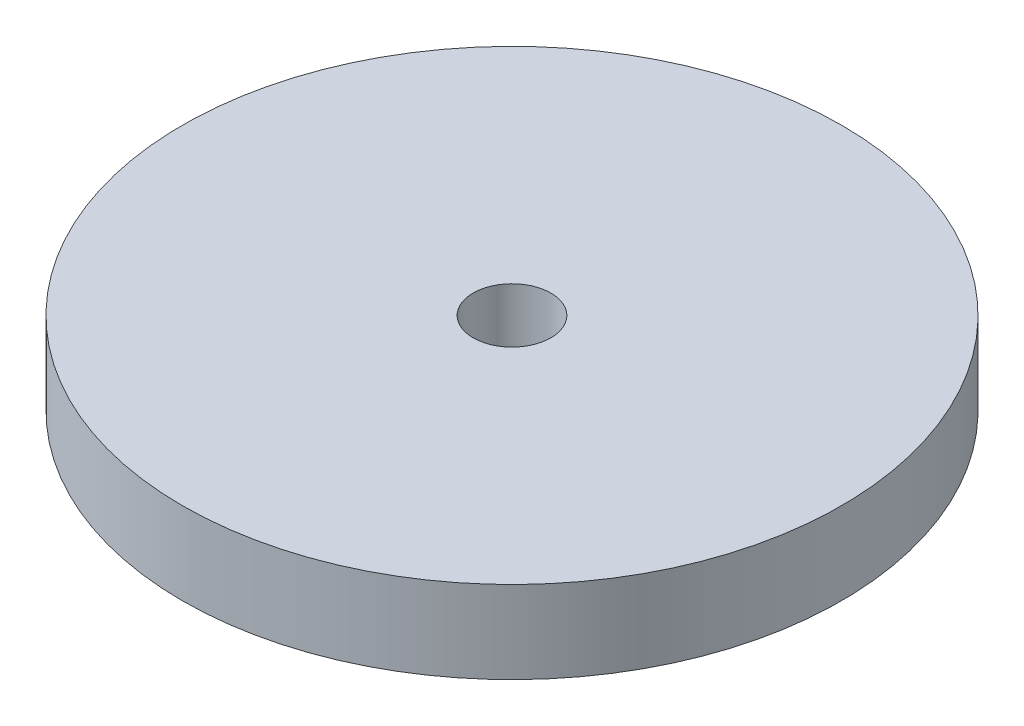
ISO-10303-21;
HEADER;
FILE_DESCRIPTION(('STEP AP214'),'2;1');
FILE_NAME('part.step','',(''),(''),'','','');
FILE_SCHEMA(('AUTOMOTIVE_DESIGN { 1 0 10303 214 1 1 1 1 }'));
ENDSEC;
DATA;
#1=APPLICATION_CONTEXT('core data for automotive mechanical design processes');
#2=APPLICATION_PROTOCOL_DEFINITION('international standard','automotive_design',2000,#1);
#3=PRODUCT_CONTEXT('',#1,'mechanical');
#4=PRODUCT('Part','Part','',(#3));
#5=PRODUCT_RELATED_PRODUCT_CATEGORY('part','',(#4));
#6=PRODUCT_DEFINITION_FORMATION('','',#4);
#7=PRODUCT_DEFINITION_CONTEXT('part definition',#1,'design');
#8=PRODUCT_DEFINITION('design','',#6,#7);
#9=PRODUCT_DEFINITION_SHAPE('','',#8);
#10=(LENGTH_UNIT() NAMED_UNIT(*) SI_UNIT(.MILLI.,.METRE.));
#11=(NAMED_UNIT(*) PLANE_ANGLE_UNIT() SI_UNIT($,.RADIAN.));
#12=(NAMED_UNIT(*) SI_UNIT($,.STERADIAN.) SOLID_ANGLE_UNIT());
#13=UNCERTAINTY_MEASURE_WITH_UNIT(LENGTH_MEASURE(1.E-05),#10,'distance_accuracy_value','');
#14=(GEOMETRIC_REPRESENTATION_CONTEXT(3) GLOBAL_UNCERTAINTY_ASSIGNED_CONTEXT((#13)) GLOBAL_UNIT_ASSIGNED_CONTEXT((#10,
#11,#12)) REPRESENTATION_CONTEXT('',''));
#15=CARTESIAN_POINT('',(0.,0.,0.));
#16=DIRECTION('',(0.,0.,1.));
#17=DIRECTION('',(1.,0.,0.));
#18=AXIS2_PLACEMENT_3D('',#15,#16,#17);
#19=CARTESIAN_POINT('',(0.,4.,0.));
#20=DIRECTION('',(0.,-1.,0.));
#21=DIRECTION('',(0.,0.,-1.));
#22=AXIS2_PLACEMENT_3D('',#19,#20,#21);
#23=CYLINDRICAL_SURFACE('',#22,14.);
#24=CARTESIAN_POINT('',(0.,4.,0.));
#25=DIRECTION('',(0.,1.,0.));
#26=DIRECTION('',(0.,0.,1.));
#27=AXIS2_PLACEMENT_3D('',#24,#25,#26);
#28=CIRCLE('',#27,14.);
#29=CARTESIAN_POINT('',(0.,4.,14.));
#30=VERTEX_POINT('',#29);
#31=EDGE_CURVE('E10',#30,#30,#28,.T.);
#32=ORIENTED_EDGE('',*,*,#31,.F.);
#33=EDGE_LOOP('',(#32));
#34=FACE_BOUND('',#33,.T.);
#35=CARTESIAN_POINT('',(0.,0.5,0.));
#36=DIRECTION('',(0.,-1.,0.));
#37=DIRECTION('',(0.,0.,-1.));
#38=AXIS2_PLACEMENT_3D('',#35,#36,#37);
#39=CIRCLE('',#38,14.);
#40=CARTESIAN_POINT('',(0.,0.5,-14.));
#41=VERTEX_POINT('',#40);
#42=EDGE_CURVE('E43',#41,#41,#39,.T.);
#43=ORIENTED_EDGE('',*,*,#42,.F.);
#44=EDGE_LOOP('',(#43));
#45=FACE_BOUND('',#44,.T.);
#46=ADVANCED_FACE('F37',(#34,#45),#23,.T.);
#47=CARTESIAN_POINT('',(0.,4.,0.));
#48=DIRECTION('',(0.,1.,0.));
#49=DIRECTION('',(0.,0.,1.));
#50=AXIS2_PLACEMENT_3D('',#47,#48,#49);
#51=PLANE('',#50);
#52=CARTESIAN_POINT('',(0.,4.,0.));
#53=DIRECTION('',(0.,1.,0.));
#54=DIRECTION('',(0.,0.,1.));
#55=AXIS2_PLACEMENT_3D('',#52,#53,#54);
#56=CIRCLE('',#55,1.65);
#57=CARTESIAN_POINT('',(0.,4.,1.65));
#58=VERTEX_POINT('',#57);
#59=EDGE_CURVE('E59',#58,#58,#56,.T.);
#60=ORIENTED_EDGE('',*,*,#59,.F.);
#61=EDGE_LOOP('',(#60));
#62=FACE_BOUND('',#61,.T.);
#63=ORIENTED_EDGE('',*,*,#31,.T.);
#64=EDGE_LOOP('',(#63));
#65=FACE_BOUND('',#64,.T.);
#66=ADVANCED_FACE('F65',(#62,#65),#51,.T.);
#67=CARTESIAN_POINT('',(0.,0.5,0.));
#68=DIRECTION('',(0.,-1.,0.));
#69=DIRECTION('',(0.,0.,-1.));
#70=AXIS2_PLACEMENT_3D('',#67,#68,#69);
#71=PLANE('',#70);
#72=CARTESIAN_POINT('',(0.,0.5,0.));
#73=DIRECTION('',(0.,-1.,0.));
#74=DIRECTION('',(0.,0.,-1.));
#75=AXIS2_PLACEMENT_3D('',#72,#73,#74);
#76=CIRCLE('',#75,6.5);
#77=CARTESIAN_POINT('',(0.,0.5,-6.5));
#78=VERTEX_POINT('',#77);
#79=EDGE_CURVE('E47',#78,#78,#76,.T.);
#80=ORIENTED_EDGE('',*,*,#79,.F.);
#81=EDGE_LOOP('',(#80));
#82=FACE_BOUND('',#81,.T.);
#83=ORIENTED_EDGE('',*,*,#42,.T.);
#84=EDGE_LOOP('',(#83));
#85=FACE_BOUND('',#84,.T.);
#86=ADVANCED_FACE('F67',(#82,#85),#71,.T.);
#87=CARTESIAN_POINT('',(0.,0.5,0.));
#88=DIRECTION('',(0.,-1.,0.));
#89=DIRECTION('',(0.,0.,-1.));
#90=AXIS2_PLACEMENT_3D('',#87,#88,#89);
#91=CYLINDRICAL_SURFACE('',#90,6.5);
#92=ORIENTED_EDGE('',*,*,#79,.T.);
#93=EDGE_LOOP('',(#92));
#94=FACE_BOUND('',#93,.T.);
#95=CARTESIAN_POINT('',(0.,0.,0.));
#96=DIRECTION('',(0.,-1.,0.));
#97=DIRECTION('',(0.,0.,-1.));
#98=AXIS2_PLACEMENT_3D('',#95,#96,#97);
#99=CIRCLE('',#98,6.5);
#100=CARTESIAN_POINT('',(0.,0.,-6.5));
#101=VERTEX_POINT('',#100);
#102=EDGE_CURVE('E51',#101,#101,#99,.T.);
#103=ORIENTED_EDGE('',*,*,#102,.F.);
#104=EDGE_LOOP('',(#103));
#105=FACE_BOUND('',#104,.T.);
#106=ADVANCED_FACE('F74',(#94,#105),#91,.T.);
#107=CARTESIAN_POINT('',(0.,0.,0.));
#108=DIRECTION('',(0.,1.,0.));
#109=DIRECTION('',(0.,0.,1.));
#110=AXIS2_PLACEMENT_3D('',#107,#108,#109);
#111=PLANE('',#110);
#112=CARTESIAN_POINT('',(0.,0.,0.));
#113=DIRECTION('',(0.,1.,0.));
#114=DIRECTION('',(0.,0.,1.));
#115=AXIS2_PLACEMENT_3D('',#112,#113,#114);
#116=CIRCLE('',#115,1.65);
#117=CARTESIAN_POINT('',(0.,0.,1.65));
#118=VERTEX_POINT('',#117);
#119=EDGE_CURVE('E55',#118,#118,#116,.F.);
#120=ORIENTED_EDGE('',*,*,#119,.F.);
#121=EDGE_LOOP('',(#120));
#122=FACE_BOUND('',#121,.T.);
#123=ORIENTED_EDGE('',*,*,#102,.T.);
#124=EDGE_LOOP('',(#123));
#125=FACE_BOUND('',#124,.T.);
#126=ADVANCED_FACE('F80',(#122,#125),#111,.F.);
#127=CARTESIAN_POINT('',(0.,-4.66690475583121,0.));
#128=DIRECTION('',(0.,1.,0.));
#129=DIRECTION('',(0.,0.,1.));
#130=AXIS2_PLACEMENT_3D('',#127,#128,#129);
#131=CYLINDRICAL_SURFACE('',#130,1.65);
#132=ORIENTED_EDGE('',*,*,#119,.T.);
#133=EDGE_LOOP('',(#132));
#134=FACE_BOUND('',#133,.T.);
#135=ORIENTED_EDGE('',*,*,#59,.T.);
#136=EDGE_LOOP('',(#135));
#137=FACE_BOUND('',#136,.T.);
#138=ADVANCED_FACE('F63',(#134,#137),#131,.F.);
#139=CLOSED_SHELL('',(#46,#66,#86,#106,#126,#138));
#140=MANIFOLD_SOLID_BREP('B2',#139);
#141=ADVANCED_BREP_SHAPE_REPRESENTATION('',(#18,#140),#14);
#142=SHAPE_DEFINITION_REPRESENTATION(#9,#141);
ENDSEC;
END-ISO-10303-21;
